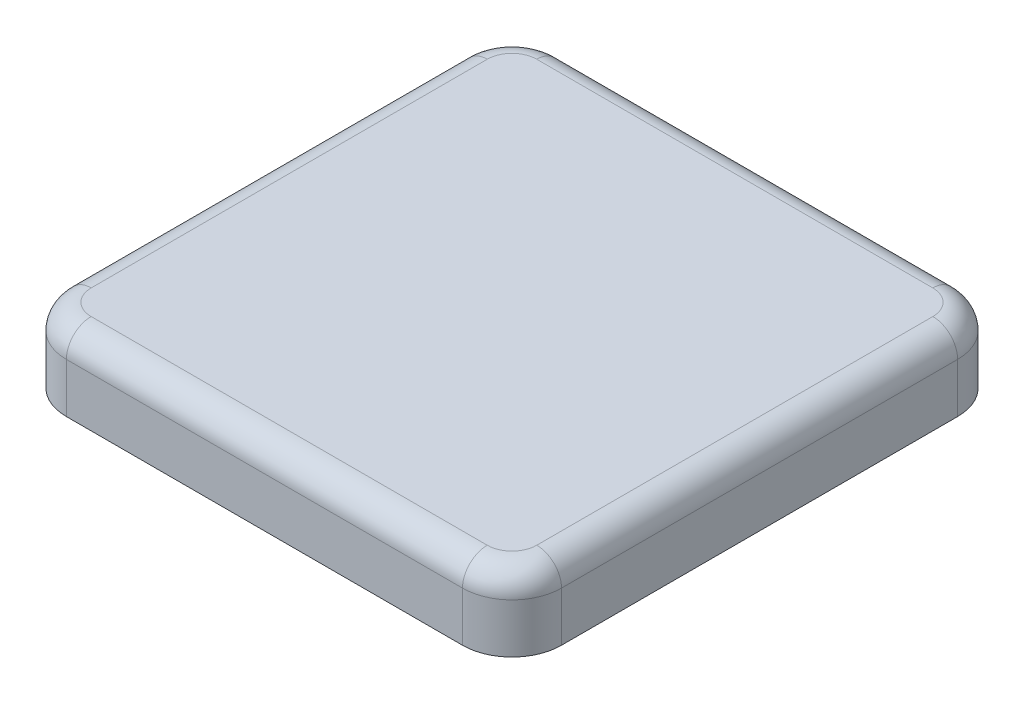
ISO-10303-21;
HEADER;
FILE_DESCRIPTION(('STEP AP214'),'2;1');
FILE_NAME('part.step','',(''),(''),'','','');
FILE_SCHEMA(('AUTOMOTIVE_DESIGN { 1 0 10303 214 1 1 1 1 }'));
ENDSEC;
DATA;
#1=APPLICATION_CONTEXT('core data for automotive mechanical design processes');
#2=APPLICATION_PROTOCOL_DEFINITION('international standard','automotive_design',2000,#1);
#3=PRODUCT_CONTEXT('',#1,'mechanical');
#4=PRODUCT('Part','Part','',(#3));
#5=PRODUCT_RELATED_PRODUCT_CATEGORY('part','',(#4));
#6=PRODUCT_DEFINITION_FORMATION('','',#4);
#7=PRODUCT_DEFINITION_CONTEXT('part definition',#1,'design');
#8=PRODUCT_DEFINITION('design','',#6,#7);
#9=PRODUCT_DEFINITION_SHAPE('','',#8);
#10=(LENGTH_UNIT() NAMED_UNIT(*) SI_UNIT(.MILLI.,.METRE.));
#11=(NAMED_UNIT(*) PLANE_ANGLE_UNIT() SI_UNIT($,.RADIAN.));
#12=(NAMED_UNIT(*) SI_UNIT($,.STERADIAN.) SOLID_ANGLE_UNIT());
#13=UNCERTAINTY_MEASURE_WITH_UNIT(LENGTH_MEASURE(1.E-05),#10,'distance_accuracy_value','');
#14=(GEOMETRIC_REPRESENTATION_CONTEXT(3) GLOBAL_UNCERTAINTY_ASSIGNED_CONTEXT((#13)) GLOBAL_UNIT_ASSIGNED_CONTEXT((#10,
#11,#12)) REPRESENTATION_CONTEXT('',''));
#15=CARTESIAN_POINT('',(0.,0.,0.));
#16=DIRECTION('',(0.,0.,1.));
#17=DIRECTION('',(1.,0.,0.));
#18=AXIS2_PLACEMENT_3D('',#15,#16,#17);
#19=CARTESIAN_POINT('',(2.5,2.5,-2.5));
#20=DIRECTION('',(-1.,0.,0.));
#21=DIRECTION('',(0.,0.,1.));
#22=AXIS2_PLACEMENT_3D('',#19,#20,#21);
#23=PLANE('',#22);
#24=DIRECTION('',(0.,0.,-1.));
#25=VECTOR('',#24,1.);
#26=CARTESIAN_POINT('',(2.5,0.,-2.5));
#27=LINE('',#26,#25);
#28=CARTESIAN_POINT('',(2.5,0.,2.5));
#29=VERTEX_POINT('',#28);
#30=CARTESIAN_POINT('',(2.5,0.,-2.5));
#31=VERTEX_POINT('',#30);
#32=EDGE_CURVE('E244',#29,#31,#27,.T.);
#33=ORIENTED_EDGE('',*,*,#32,.T.);
#34=DIRECTION('',(0.,-1.,0.));
#35=VECTOR('',#34,1.);
#36=CARTESIAN_POINT('',(2.5,2.5,-2.5));
#37=LINE('',#36,#35);
#38=CARTESIAN_POINT('',(2.5,4.5,-2.5));
#39=VERTEX_POINT('',#38);
#40=EDGE_CURVE('E190',#39,#31,#37,.T.);
#41=ORIENTED_EDGE('',*,*,#40,.F.);
#42=DIRECTION('',(0.,0.,-1.));
#43=VECTOR('',#42,1.);
#44=CARTESIAN_POINT('',(2.5,4.5,2.5));
#45=LINE('',#44,#43);
#46=CARTESIAN_POINT('',(2.5,4.5,2.5));
#47=VERTEX_POINT('',#46);
#48=EDGE_CURVE('E184',#47,#39,#45,.T.);
#49=ORIENTED_EDGE('',*,*,#48,.F.);
#50=DIRECTION('',(0.,-1.,0.));
#51=VECTOR('',#50,1.);
#52=CARTESIAN_POINT('',(2.5,2.5,2.5));
#53=LINE('',#52,#51);
#54=EDGE_CURVE('E187',#47,#29,#53,.T.);
#55=ORIENTED_EDGE('',*,*,#54,.T.);
#56=EDGE_LOOP('',(#33,#41,#49,#55));
#57=FACE_BOUND('',#56,.T.);
#58=ADVANCED_FACE('F45',(#57),#23,.F.);
#59=CARTESIAN_POINT('',(-2.5,2.5,-2.5));
#60=DIRECTION('',(0.,0.,1.));
#61=DIRECTION('',(1.,0.,0.));
#62=AXIS2_PLACEMENT_3D('',#59,#60,#61);
#63=PLANE('',#62);
#64=DIRECTION('',(-1.,0.,0.));
#65=VECTOR('',#64,1.);
#66=CARTESIAN_POINT('',(-2.5,0.,-2.5));
#67=LINE('',#66,#65);
#68=CARTESIAN_POINT('',(-2.5,0.,-2.5));
#69=VERTEX_POINT('',#68);
#70=EDGE_CURVE('E254',#31,#69,#67,.T.);
#71=ORIENTED_EDGE('',*,*,#70,.T.);
#72=DIRECTION('',(0.,-1.,0.));
#73=VECTOR('',#72,1.);
#74=CARTESIAN_POINT('',(-2.5,2.5,-2.5));
#75=LINE('',#74,#73);
#76=CARTESIAN_POINT('',(-2.5,4.5,-2.5));
#77=VERTEX_POINT('',#76);
#78=EDGE_CURVE('E260',#77,#69,#75,.T.);
#79=ORIENTED_EDGE('',*,*,#78,.F.);
#80=DIRECTION('',(-1.,0.,0.));
#81=VECTOR('',#80,1.);
#82=CARTESIAN_POINT('',(-2.5,4.5,-2.5));
#83=LINE('',#82,#81);
#84=EDGE_CURVE('E195',#39,#77,#83,.T.);
#85=ORIENTED_EDGE('',*,*,#84,.F.);
#86=ORIENTED_EDGE('',*,*,#40,.T.);
#87=EDGE_LOOP('',(#71,#79,#85,#86));
#88=FACE_BOUND('',#87,.T.);
#89=ADVANCED_FACE('F359',(#88),#63,.F.);
#90=CARTESIAN_POINT('',(-2.5,2.5,-2.5));
#91=DIRECTION('',(1.,0.,0.));
#92=DIRECTION('',(0.,0.,-1.));
#93=AXIS2_PLACEMENT_3D('',#90,#91,#92);
#94=PLANE('',#93);
#95=DIRECTION('',(0.,0.,1.));
#96=VECTOR('',#95,1.);
#97=CARTESIAN_POINT('',(-2.5,0.,-2.5));
#98=LINE('',#97,#96);
#99=CARTESIAN_POINT('',(-2.5,0.,2.5));
#100=VERTEX_POINT('',#99);
#101=EDGE_CURVE('E256',#69,#100,#98,.T.);
#102=ORIENTED_EDGE('',*,*,#101,.T.);
#103=DIRECTION('',(0.,-1.,0.));
#104=VECTOR('',#103,1.);
#105=CARTESIAN_POINT('',(-2.5,2.5,2.5));
#106=LINE('',#105,#104);
#107=CARTESIAN_POINT('',(-2.5,4.5,2.5));
#108=VERTEX_POINT('',#107);
#109=EDGE_CURVE('E206',#108,#100,#106,.T.);
#110=ORIENTED_EDGE('',*,*,#109,.F.);
#111=DIRECTION('',(0.,0.,1.));
#112=VECTOR('',#111,1.);
#113=CARTESIAN_POINT('',(-2.5,4.5,2.5));
#114=LINE('',#113,#112);
#115=EDGE_CURVE('E211',#77,#108,#114,.T.);
#116=ORIENTED_EDGE('',*,*,#115,.F.);
#117=ORIENTED_EDGE('',*,*,#78,.T.);
#118=EDGE_LOOP('',(#102,#110,#116,#117));
#119=FACE_BOUND('',#118,.T.);
#120=ADVANCED_FACE('F362',(#119),#94,.F.);
#121=CARTESIAN_POINT('',(-2.5,2.5,2.5));
#122=DIRECTION('',(0.,0.,-1.));
#123=DIRECTION('',(-1.,0.,0.));
#124=AXIS2_PLACEMENT_3D('',#121,#122,#123);
#125=PLANE('',#124);
#126=DIRECTION('',(1.,0.,0.));
#127=VECTOR('',#126,1.);
#128=CARTESIAN_POINT('',(-2.5,0.,2.5));
#129=LINE('',#128,#127);
#130=EDGE_CURVE('E205',#100,#29,#129,.T.);
#131=ORIENTED_EDGE('',*,*,#130,.T.);
#132=ORIENTED_EDGE('',*,*,#54,.F.);
#133=DIRECTION('',(1.,0.,0.));
#134=VECTOR('',#133,1.);
#135=CARTESIAN_POINT('',(-2.5,4.5,2.5));
#136=LINE('',#135,#134);
#137=EDGE_CURVE('E202',#108,#47,#136,.T.);
#138=ORIENTED_EDGE('',*,*,#137,.F.);
#139=ORIENTED_EDGE('',*,*,#109,.T.);
#140=EDGE_LOOP('',(#131,#132,#138,#139));
#141=FACE_BOUND('',#140,.T.);
#142=ADVANCED_FACE('F200',(#141),#125,.F.);
#143=CARTESIAN_POINT('',(0.,0.,0.));
#144=DIRECTION('',(0.,1.,0.));
#145=DIRECTION('',(0.,0.,1.));
#146=AXIS2_PLACEMENT_3D('',#143,#144,#145);
#147=PLANE('',#146);
#148=DIRECTION('',(1.,0.,0.));
#149=VECTOR('',#148,1.);
#150=CARTESIAN_POINT('',(-2.,0.,2.));
#151=LINE('',#150,#149);
#152=CARTESIAN_POINT('',(-2.,0.,2.));
#153=VERTEX_POINT('',#152);
#154=CARTESIAN_POINT('',(2.,0.,2.));
#155=VERTEX_POINT('',#154);
#156=EDGE_CURVE('E230',#153,#155,#151,.T.);
#157=ORIENTED_EDGE('',*,*,#156,.T.);
#158=DIRECTION('',(0.,0.,-1.));
#159=VECTOR('',#158,1.);
#160=CARTESIAN_POINT('',(2.,0.,2.));
#161=LINE('',#160,#159);
#162=CARTESIAN_POINT('',(2.,0.,-2.));
#163=VERTEX_POINT('',#162);
#164=EDGE_CURVE('E220',#155,#163,#161,.T.);
#165=ORIENTED_EDGE('',*,*,#164,.T.);
#166=DIRECTION('',(-1.,0.,0.));
#167=VECTOR('',#166,1.);
#168=CARTESIAN_POINT('',(-2.,0.,-2.));
#169=LINE('',#168,#167);
#170=CARTESIAN_POINT('',(-2.,0.,-2.));
#171=VERTEX_POINT('',#170);
#172=EDGE_CURVE('E223',#163,#171,#169,.T.);
#173=ORIENTED_EDGE('',*,*,#172,.T.);
#174=DIRECTION('',(0.,0.,1.));
#175=VECTOR('',#174,1.);
#176=CARTESIAN_POINT('',(-2.,0.,2.));
#177=LINE('',#176,#175);
#178=EDGE_CURVE('E227',#171,#153,#177,.T.);
#179=ORIENTED_EDGE('',*,*,#178,.T.);
#180=EDGE_LOOP('',(#157,#165,#173,#179));
#181=FACE_BOUND('',#180,.T.);
#182=ORIENTED_EDGE('',*,*,#32,.F.);
#183=ORIENTED_EDGE('',*,*,#130,.F.);
#184=ORIENTED_EDGE('',*,*,#101,.F.);
#185=ORIENTED_EDGE('',*,*,#70,.F.);
#186=EDGE_LOOP('',(#182,#183,#184,#185));
#187=FACE_BOUND('',#186,.T.);
#188=ADVANCED_FACE('F364',(#181,#187),#147,.F.);
#189=CARTESIAN_POINT('',(2.,0.,2.));
#190=DIRECTION('',(1.,0.,0.));
#191=DIRECTION('',(0.,0.,-1.));
#192=AXIS2_PLACEMENT_3D('',#189,#190,#191);
#193=PLANE('',#192);
#194=DIRECTION('',(0.,0.,-1.));
#195=VECTOR('',#194,1.);
#196=CARTESIAN_POINT('',(2.,2.5,2.));
#197=LINE('',#196,#195);
#198=CARTESIAN_POINT('',(2.,2.5,2.));
#199=VERTEX_POINT('',#198);
#200=CARTESIAN_POINT('',(2.,2.5,-2.));
#201=VERTEX_POINT('',#200);
#202=EDGE_CURVE('E212',#199,#201,#197,.T.);
#203=ORIENTED_EDGE('',*,*,#202,.T.);
#204=DIRECTION('',(0.,1.,0.));
#205=VECTOR('',#204,1.);
#206=CARTESIAN_POINT('',(2.,0.,-2.));
#207=LINE('',#206,#205);
#208=EDGE_CURVE('E232',#163,#201,#207,.T.);
#209=ORIENTED_EDGE('',*,*,#208,.F.);
#210=ORIENTED_EDGE('',*,*,#164,.F.);
#211=DIRECTION('',(0.,1.,0.));
#212=VECTOR('',#211,1.);
#213=CARTESIAN_POINT('',(2.,0.,2.));
#214=LINE('',#213,#212);
#215=EDGE_CURVE('E241',#155,#199,#214,.T.);
#216=ORIENTED_EDGE('',*,*,#215,.T.);
#217=EDGE_LOOP('',(#203,#209,#210,#216));
#218=FACE_BOUND('',#217,.T.);
#219=ADVANCED_FACE('F366',(#218),#193,.F.);
#220=CARTESIAN_POINT('',(-2.,0.,2.));
#221=DIRECTION('',(0.,0.,1.));
#222=DIRECTION('',(1.,0.,0.));
#223=AXIS2_PLACEMENT_3D('',#220,#221,#222);
#224=PLANE('',#223);
#225=DIRECTION('',(1.,0.,0.));
#226=VECTOR('',#225,1.);
#227=CARTESIAN_POINT('',(-2.,2.5,2.));
#228=LINE('',#227,#226);
#229=CARTESIAN_POINT('',(-2.,2.5,2.));
#230=VERTEX_POINT('',#229);
#231=EDGE_CURVE('E224',#230,#199,#228,.T.);
#232=ORIENTED_EDGE('',*,*,#231,.T.);
#233=ORIENTED_EDGE('',*,*,#215,.F.);
#234=ORIENTED_EDGE('',*,*,#156,.F.);
#235=DIRECTION('',(0.,1.,0.));
#236=VECTOR('',#235,1.);
#237=CARTESIAN_POINT('',(-2.,0.,2.));
#238=LINE('',#237,#236);
#239=EDGE_CURVE('E245',#153,#230,#238,.T.);
#240=ORIENTED_EDGE('',*,*,#239,.T.);
#241=EDGE_LOOP('',(#232,#233,#234,#240));
#242=FACE_BOUND('',#241,.T.);
#243=ADVANCED_FACE('F372',(#242),#224,.F.);
#244=CARTESIAN_POINT('',(-2.,0.,2.));
#245=DIRECTION('',(-1.,0.,0.));
#246=DIRECTION('',(0.,0.,1.));
#247=AXIS2_PLACEMENT_3D('',#244,#245,#246);
#248=PLANE('',#247);
#249=DIRECTION('',(0.,0.,1.));
#250=VECTOR('',#249,1.);
#251=CARTESIAN_POINT('',(-2.,2.5,2.));
#252=LINE('',#251,#250);
#253=CARTESIAN_POINT('',(-2.,2.5,-2.));
#254=VERTEX_POINT('',#253);
#255=EDGE_CURVE('E236',#254,#230,#252,.T.);
#256=ORIENTED_EDGE('',*,*,#255,.T.);
#257=ORIENTED_EDGE('',*,*,#239,.F.);
#258=ORIENTED_EDGE('',*,*,#178,.F.);
#259=DIRECTION('',(0.,1.,0.));
#260=VECTOR('',#259,1.);
#261=CARTESIAN_POINT('',(-2.,0.,-2.));
#262=LINE('',#261,#260);
#263=EDGE_CURVE('E248',#171,#254,#262,.T.);
#264=ORIENTED_EDGE('',*,*,#263,.T.);
#265=EDGE_LOOP('',(#256,#257,#258,#264));
#266=FACE_BOUND('',#265,.T.);
#267=ADVANCED_FACE('F482',(#266),#248,.F.);
#268=CARTESIAN_POINT('',(-2.,0.,-2.));
#269=DIRECTION('',(0.,0.,-1.));
#270=DIRECTION('',(-1.,0.,0.));
#271=AXIS2_PLACEMENT_3D('',#268,#269,#270);
#272=PLANE('',#271);
#273=DIRECTION('',(-1.,0.,0.));
#274=VECTOR('',#273,1.);
#275=CARTESIAN_POINT('',(-2.,2.5,-2.));
#276=LINE('',#275,#274);
#277=EDGE_CURVE('E215',#201,#254,#276,.T.);
#278=ORIENTED_EDGE('',*,*,#277,.T.);
#279=ORIENTED_EDGE('',*,*,#263,.F.);
#280=ORIENTED_EDGE('',*,*,#172,.F.);
#281=ORIENTED_EDGE('',*,*,#208,.T.);
#282=EDGE_LOOP('',(#278,#279,#280,#281));
#283=FACE_BOUND('',#282,.T.);
#284=ADVANCED_FACE('F475',(#283),#272,.F.);
#285=CARTESIAN_POINT('',(0.,2.5,0.));
#286=DIRECTION('',(0.,-1.,0.));
#287=DIRECTION('',(0.,0.,-1.));
#288=AXIS2_PLACEMENT_3D('',#285,#286,#287);
#289=PLANE('',#288);
#290=ORIENTED_EDGE('',*,*,#202,.F.);
#291=ORIENTED_EDGE('',*,*,#231,.F.);
#292=ORIENTED_EDGE('',*,*,#255,.F.);
#293=ORIENTED_EDGE('',*,*,#277,.F.);
#294=EDGE_LOOP('',(#290,#291,#292,#293));
#295=FACE_BOUND('',#294,.T.);
#296=ADVANCED_FACE('F468',(#295),#289,.T.);
#297=CARTESIAN_POINT('',(10.,7.5,10.));
#298=DIRECTION('',(-1.,0.,0.));
#299=DIRECTION('',(0.,0.,1.));
#300=AXIS2_PLACEMENT_3D('',#297,#298,#299);
#301=PLANE('',#300);
#302=DIRECTION('',(0.,-1.,0.));
#303=VECTOR('',#302,1.);
#304=CARTESIAN_POINT('',(10.,7.5,-8.));
#305=LINE('',#304,#303);
#306=CARTESIAN_POINT('',(10.,4.5,-8.));
#307=VERTEX_POINT('',#306);
#308=CARTESIAN_POINT('',(10.,6.5,-8.));
#309=VERTEX_POINT('',#308);
#310=EDGE_CURVE('E284',#307,#309,#305,.F.);
#311=ORIENTED_EDGE('',*,*,#310,.T.);
#312=DIRECTION('',(0.,0.,-1.));
#313=VECTOR('',#312,1.);
#314=CARTESIAN_POINT('',(10.,6.5,10.));
#315=LINE('',#314,#313);
#316=CARTESIAN_POINT('',(10.,6.5,8.));
#317=VERTEX_POINT('',#316);
#318=EDGE_CURVE('E11',#309,#317,#315,.F.);
#319=ORIENTED_EDGE('',*,*,#318,.T.);
#320=DIRECTION('',(0.,-1.,0.));
#321=VECTOR('',#320,1.);
#322=CARTESIAN_POINT('',(10.,7.5,8.));
#323=LINE('',#322,#321);
#324=CARTESIAN_POINT('',(10.,4.5,8.));
#325=VERTEX_POINT('',#324);
#326=EDGE_CURVE('E282',#317,#325,#323,.T.);
#327=ORIENTED_EDGE('',*,*,#326,.T.);
#328=DIRECTION('',(0.,0.,-1.));
#329=VECTOR('',#328,1.);
#330=CARTESIAN_POINT('',(10.,4.5,10.));
#331=LINE('',#330,#329);
#332=EDGE_CURVE('E342',#325,#307,#331,.T.);
#333=ORIENTED_EDGE('',*,*,#332,.T.);
#334=EDGE_LOOP('',(#311,#319,#327,#333));
#335=FACE_BOUND('',#334,.T.);
#336=ADVANCED_FACE('F466',(#335),#301,.F.);
#337=CARTESIAN_POINT('',(-10.,7.5,-10.));
#338=DIRECTION('',(0.,0.,1.));
#339=DIRECTION('',(1.,0.,0.));
#340=AXIS2_PLACEMENT_3D('',#337,#338,#339);
#341=PLANE('',#340);
#342=DIRECTION('',(0.,-1.,0.));
#343=VECTOR('',#342,1.);
#344=CARTESIAN_POINT('',(-8.,7.5,-10.));
#345=LINE('',#344,#343);
#346=CARTESIAN_POINT('',(-8.,4.5,-10.));
#347=VERTEX_POINT('',#346);
#348=CARTESIAN_POINT('',(-8.,6.5,-10.));
#349=VERTEX_POINT('',#348);
#350=EDGE_CURVE('E279',#347,#349,#345,.F.);
#351=ORIENTED_EDGE('',*,*,#350,.T.);
#352=DIRECTION('',(-1.,0.,0.));
#353=VECTOR('',#352,1.);
#354=CARTESIAN_POINT('',(-10.,6.5,-10.));
#355=LINE('',#354,#353);
#356=CARTESIAN_POINT('',(8.,6.5,-10.));
#357=VERTEX_POINT('',#356);
#358=EDGE_CURVE('E317',#349,#357,#355,.F.);
#359=ORIENTED_EDGE('',*,*,#358,.T.);
#360=DIRECTION('',(0.,-1.,0.));
#361=VECTOR('',#360,1.);
#362=CARTESIAN_POINT('',(8.,7.5,-10.));
#363=LINE('',#362,#361);
#364=CARTESIAN_POINT('',(8.,4.5,-10.));
#365=VERTEX_POINT('',#364);
#366=EDGE_CURVE('E277',#357,#365,#363,.T.);
#367=ORIENTED_EDGE('',*,*,#366,.T.);
#368=DIRECTION('',(-1.,0.,0.));
#369=VECTOR('',#368,1.);
#370=CARTESIAN_POINT('',(-10.,4.5,-10.));
#371=LINE('',#370,#369);
#372=EDGE_CURVE('E348',#365,#347,#371,.T.);
#373=ORIENTED_EDGE('',*,*,#372,.T.);
#374=EDGE_LOOP('',(#351,#359,#367,#373));
#375=FACE_BOUND('',#374,.T.);
#376=ADVANCED_FACE('F463',(#375),#341,.F.);
#377=CARTESIAN_POINT('',(-10.,7.5,10.));
#378=DIRECTION('',(1.,0.,0.));
#379=DIRECTION('',(0.,0.,-1.));
#380=AXIS2_PLACEMENT_3D('',#377,#378,#379);
#381=PLANE('',#380);
#382=DIRECTION('',(0.,-1.,0.));
#383=VECTOR('',#382,1.);
#384=CARTESIAN_POINT('',(-10.,7.5,8.));
#385=LINE('',#384,#383);
#386=CARTESIAN_POINT('',(-10.,4.5,8.));
#387=VERTEX_POINT('',#386);
#388=CARTESIAN_POINT('',(-10.,6.5,8.));
#389=VERTEX_POINT('',#388);
#390=EDGE_CURVE('E264',#387,#389,#385,.F.);
#391=ORIENTED_EDGE('',*,*,#390,.T.);
#392=DIRECTION('',(0.,0.,1.));
#393=VECTOR('',#392,1.);
#394=CARTESIAN_POINT('',(-10.,6.5,10.));
#395=LINE('',#394,#393);
#396=CARTESIAN_POINT('',(-10.,6.5,-8.));
#397=VERTEX_POINT('',#396);
#398=EDGE_CURVE('E313',#389,#397,#395,.F.);
#399=ORIENTED_EDGE('',*,*,#398,.T.);
#400=DIRECTION('',(0.,-1.,0.));
#401=VECTOR('',#400,1.);
#402=CARTESIAN_POINT('',(-10.,7.5,-8.));
#403=LINE('',#402,#401);
#404=CARTESIAN_POINT('',(-10.,4.5,-8.));
#405=VERTEX_POINT('',#404);
#406=EDGE_CURVE('E267',#397,#405,#403,.T.);
#407=ORIENTED_EDGE('',*,*,#406,.T.);
#408=DIRECTION('',(0.,0.,1.));
#409=VECTOR('',#408,1.);
#410=CARTESIAN_POINT('',(-10.,4.5,10.));
#411=LINE('',#410,#409);
#412=EDGE_CURVE('E352',#405,#387,#411,.T.);
#413=ORIENTED_EDGE('',*,*,#412,.T.);
#414=EDGE_LOOP('',(#391,#399,#407,#413));
#415=FACE_BOUND('',#414,.T.);
#416=ADVANCED_FACE('F455',(#415),#381,.F.);
#417=CARTESIAN_POINT('',(-10.,7.5,10.));
#418=DIRECTION('',(0.,0.,-1.));
#419=DIRECTION('',(-1.,0.,0.));
#420=AXIS2_PLACEMENT_3D('',#417,#418,#419);
#421=PLANE('',#420);
#422=DIRECTION('',(0.,-1.,0.));
#423=VECTOR('',#422,1.);
#424=CARTESIAN_POINT('',(8.,7.5,10.));
#425=LINE('',#424,#423);
#426=CARTESIAN_POINT('',(8.,4.5,10.));
#427=VERTEX_POINT('',#426);
#428=CARTESIAN_POINT('',(8.,6.5,10.));
#429=VERTEX_POINT('',#428);
#430=EDGE_CURVE('E288',#427,#429,#425,.F.);
#431=ORIENTED_EDGE('',*,*,#430,.T.);
#432=DIRECTION('',(1.,0.,0.));
#433=VECTOR('',#432,1.);
#434=CARTESIAN_POINT('',(-10.,6.5,10.));
#435=LINE('',#434,#433);
#436=CARTESIAN_POINT('',(-8.,6.5,10.));
#437=VERTEX_POINT('',#436);
#438=EDGE_CURVE('E308',#429,#437,#435,.F.);
#439=ORIENTED_EDGE('',*,*,#438,.T.);
#440=DIRECTION('',(0.,-1.,0.));
#441=VECTOR('',#440,1.);
#442=CARTESIAN_POINT('',(-8.,7.5,10.));
#443=LINE('',#442,#441);
#444=CARTESIAN_POINT('',(-8.,4.5,10.));
#445=VERTEX_POINT('',#444);
#446=EDGE_CURVE('E286',#437,#445,#443,.T.);
#447=ORIENTED_EDGE('',*,*,#446,.T.);
#448=DIRECTION('',(1.,0.,0.));
#449=VECTOR('',#448,1.);
#450=CARTESIAN_POINT('',(-10.,4.5,10.));
#451=LINE('',#450,#449);
#452=EDGE_CURVE('E196',#445,#427,#451,.T.);
#453=ORIENTED_EDGE('',*,*,#452,.T.);
#454=EDGE_LOOP('',(#431,#439,#447,#453));
#455=FACE_BOUND('',#454,.T.);
#456=ADVANCED_FACE('F443',(#455),#421,.F.);
#457=CARTESIAN_POINT('',(0.,7.5,0.));
#458=DIRECTION('',(0.,-1.,0.));
#459=DIRECTION('',(0.,0.,-1.));
#460=AXIS2_PLACEMENT_3D('',#457,#458,#459);
#461=PLANE('',#460);
#462=CARTESIAN_POINT('',(-8.,7.5,8.));
#463=DIRECTION('',(0.,-1.,0.));
#464=DIRECTION('',(0.,0.,-1.));
#465=AXIS2_PLACEMENT_3D('',#462,#463,#464);
#466=CIRCLE('',#465,1.);
#467=CARTESIAN_POINT('',(-9.00000000000001,7.5,8.));
#468=VERTEX_POINT('',#467);
#469=CARTESIAN_POINT('',(-8.,7.5,9.));
#470=VERTEX_POINT('',#469);
#471=EDGE_CURVE('E303',#468,#470,#466,.F.);
#472=ORIENTED_EDGE('',*,*,#471,.T.);
#473=DIRECTION('',(1.,0.,0.));
#474=VECTOR('',#473,1.);
#475=CARTESIAN_POINT('',(0.,7.5,9.));
#476=LINE('',#475,#474);
#477=CARTESIAN_POINT('',(8.,7.5,9.));
#478=VERTEX_POINT('',#477);
#479=EDGE_CURVE('E305',#470,#478,#476,.T.);
#480=ORIENTED_EDGE('',*,*,#479,.T.);
#481=CARTESIAN_POINT('',(8.,7.5,8.));
#482=DIRECTION('',(0.,-1.,0.));
#483=DIRECTION('',(0.,0.,-1.));
#484=AXIS2_PLACEMENT_3D('',#481,#482,#483);
#485=CIRCLE('',#484,1.);
#486=CARTESIAN_POINT('',(9.,7.5,8.));
#487=VERTEX_POINT('',#486);
#488=EDGE_CURVE('E293',#478,#487,#485,.F.);
#489=ORIENTED_EDGE('',*,*,#488,.T.);
#490=DIRECTION('',(0.,0.,-1.));
#491=VECTOR('',#490,1.);
#492=CARTESIAN_POINT('',(9.,7.5,0.));
#493=LINE('',#492,#491);
#494=CARTESIAN_POINT('',(9.,7.5,-8.));
#495=VERTEX_POINT('',#494);
#496=EDGE_CURVE('E291',#487,#495,#493,.T.);
#497=ORIENTED_EDGE('',*,*,#496,.T.);
#498=CARTESIAN_POINT('',(8.,7.5,-8.));
#499=DIRECTION('',(0.,-1.,0.));
#500=DIRECTION('',(0.,0.,-1.));
#501=AXIS2_PLACEMENT_3D('',#498,#499,#500);
#502=CIRCLE('',#501,1.);
#503=CARTESIAN_POINT('',(8.,7.5,-9.));
#504=VERTEX_POINT('',#503);
#505=EDGE_CURVE('E295',#495,#504,#502,.F.);
#506=ORIENTED_EDGE('',*,*,#505,.T.);
#507=DIRECTION('',(-1.,0.,0.));
#508=VECTOR('',#507,1.);
#509=CARTESIAN_POINT('',(0.,7.5,-9.));
#510=LINE('',#509,#508);
#511=CARTESIAN_POINT('',(-8.,7.5,-9.));
#512=VERTEX_POINT('',#511);
#513=EDGE_CURVE('E297',#504,#512,#510,.T.);
#514=ORIENTED_EDGE('',*,*,#513,.T.);
#515=CARTESIAN_POINT('',(-8.,7.5,-8.));
#516=DIRECTION('',(0.,-1.,0.));
#517=DIRECTION('',(0.,0.,-1.));
#518=AXIS2_PLACEMENT_3D('',#515,#516,#517);
#519=CIRCLE('',#518,1.);
#520=CARTESIAN_POINT('',(-9.00000000000001,7.5,-8.));
#521=VERTEX_POINT('',#520);
#522=EDGE_CURVE('E299',#512,#521,#519,.F.);
#523=ORIENTED_EDGE('',*,*,#522,.T.);
#524=DIRECTION('',(0.,0.,1.));
#525=VECTOR('',#524,1.);
#526=CARTESIAN_POINT('',(-9.00000000000001,7.5,0.));
#527=LINE('',#526,#525);
#528=EDGE_CURVE('E301',#521,#468,#527,.T.);
#529=ORIENTED_EDGE('',*,*,#528,.T.);
#530=EDGE_LOOP('',(#472,#480,#489,#497,#506,#514,#523,#529));
#531=FACE_BOUND('',#530,.T.);
#532=ADVANCED_FACE('F534',(#531),#461,.F.);
#533=CARTESIAN_POINT('',(0.,4.5,0.));
#534=DIRECTION('',(0.,-1.,0.));
#535=DIRECTION('',(0.,0.,-1.));
#536=AXIS2_PLACEMENT_3D('',#533,#534,#535);
#537=PLANE('',#536);
#538=ORIENTED_EDGE('',*,*,#137,.T.);
#539=ORIENTED_EDGE('',*,*,#48,.T.);
#540=ORIENTED_EDGE('',*,*,#84,.T.);
#541=ORIENTED_EDGE('',*,*,#115,.T.);
#542=EDGE_LOOP('',(#538,#539,#540,#541));
#543=FACE_BOUND('',#542,.T.);
#544=ORIENTED_EDGE('',*,*,#412,.F.);
#545=CARTESIAN_POINT('',(-8.,4.5,-8.));
#546=DIRECTION('',(0.,-1.,0.));
#547=DIRECTION('',(0.,0.,-1.));
#548=AXIS2_PLACEMENT_3D('',#545,#546,#547);
#549=CIRCLE('',#548,2.);
#550=EDGE_CURVE('E275',#405,#347,#549,.T.);
#551=ORIENTED_EDGE('',*,*,#550,.T.);
#552=ORIENTED_EDGE('',*,*,#372,.F.);
#553=CARTESIAN_POINT('',(8.,4.5,-8.));
#554=DIRECTION('',(0.,-1.,0.));
#555=DIRECTION('',(0.,0.,-1.));
#556=AXIS2_PLACEMENT_3D('',#553,#554,#555);
#557=CIRCLE('',#556,2.);
#558=EDGE_CURVE('E273',#365,#307,#557,.T.);
#559=ORIENTED_EDGE('',*,*,#558,.T.);
#560=ORIENTED_EDGE('',*,*,#332,.F.);
#561=CARTESIAN_POINT('',(8.,4.5,8.));
#562=DIRECTION('',(0.,-1.,0.));
#563=DIRECTION('',(0.,0.,-1.));
#564=AXIS2_PLACEMENT_3D('',#561,#562,#563);
#565=CIRCLE('',#564,2.);
#566=EDGE_CURVE('E271',#325,#427,#565,.T.);
#567=ORIENTED_EDGE('',*,*,#566,.T.);
#568=ORIENTED_EDGE('',*,*,#452,.F.);
#569=CARTESIAN_POINT('',(-8.,4.5,8.));
#570=DIRECTION('',(0.,-1.,0.));
#571=DIRECTION('',(0.,0.,-1.));
#572=AXIS2_PLACEMENT_3D('',#569,#570,#571);
#573=CIRCLE('',#572,2.);
#574=EDGE_CURVE('E269',#445,#387,#573,.T.);
#575=ORIENTED_EDGE('',*,*,#574,.T.);
#576=EDGE_LOOP('',(#544,#551,#552,#559,#560,#567,#568,#575));
#577=FACE_BOUND('',#576,.T.);
#578=ADVANCED_FACE('F208',(#543,#577),#537,.T.);
#579=CARTESIAN_POINT('',(-8.,7.5,-8.));
#580=DIRECTION('',(0.,-1.,0.));
#581=DIRECTION('',(0.,0.,-1.));
#582=AXIS2_PLACEMENT_3D('',#579,#580,#581);
#583=CYLINDRICAL_SURFACE('',#582,2.);
#584=ORIENTED_EDGE('',*,*,#406,.F.);
#585=CARTESIAN_POINT('',(-8.,6.5,-8.));
#586=DIRECTION('',(0.,-1.,0.));
#587=DIRECTION('',(0.,0.,-1.));
#588=AXIS2_PLACEMENT_3D('',#585,#586,#587);
#589=CIRCLE('',#588,2.);
#590=EDGE_CURVE('E315',#397,#349,#589,.T.);
#591=ORIENTED_EDGE('',*,*,#590,.T.);
#592=ORIENTED_EDGE('',*,*,#350,.F.);
#593=ORIENTED_EDGE('',*,*,#550,.F.);
#594=EDGE_LOOP('',(#584,#591,#592,#593));
#595=FACE_BOUND('',#594,.T.);
#596=ADVANCED_FACE('F386',(#595),#583,.T.);
#597=CARTESIAN_POINT('',(8.,7.5,-8.));
#598=DIRECTION('',(0.,-1.,0.));
#599=DIRECTION('',(0.,0.,-1.));
#600=AXIS2_PLACEMENT_3D('',#597,#598,#599);
#601=CYLINDRICAL_SURFACE('',#600,2.);
#602=ORIENTED_EDGE('',*,*,#366,.F.);
#603=CARTESIAN_POINT('',(8.,6.5,-8.));
#604=DIRECTION('',(0.,-1.,0.));
#605=DIRECTION('',(0.,0.,-1.));
#606=AXIS2_PLACEMENT_3D('',#603,#604,#605);
#607=CIRCLE('',#606,2.);
#608=EDGE_CURVE('E68',#357,#309,#607,.T.);
#609=ORIENTED_EDGE('',*,*,#608,.T.);
#610=ORIENTED_EDGE('',*,*,#310,.F.);
#611=ORIENTED_EDGE('',*,*,#558,.F.);
#612=EDGE_LOOP('',(#602,#609,#610,#611));
#613=FACE_BOUND('',#612,.T.);
#614=ADVANCED_FACE('F389',(#613),#601,.T.);
#615=CARTESIAN_POINT('',(8.,7.5,8.));
#616=DIRECTION('',(0.,-1.,0.));
#617=DIRECTION('',(0.,0.,-1.));
#618=AXIS2_PLACEMENT_3D('',#615,#616,#617);
#619=CYLINDRICAL_SURFACE('',#618,2.);
#620=ORIENTED_EDGE('',*,*,#326,.F.);
#621=CARTESIAN_POINT('',(8.,6.5,8.));
#622=DIRECTION('',(0.,-1.,0.));
#623=DIRECTION('',(0.,0.,-1.));
#624=AXIS2_PLACEMENT_3D('',#621,#622,#623);
#625=CIRCLE('',#624,2.);
#626=EDGE_CURVE('E54',#317,#429,#625,.T.);
#627=ORIENTED_EDGE('',*,*,#626,.T.);
#628=ORIENTED_EDGE('',*,*,#430,.F.);
#629=ORIENTED_EDGE('',*,*,#566,.F.);
#630=EDGE_LOOP('',(#620,#627,#628,#629));
#631=FACE_BOUND('',#630,.T.);
#632=ADVANCED_FACE('F393',(#631),#619,.T.);
#633=CARTESIAN_POINT('',(-8.,7.5,8.));
#634=DIRECTION('',(0.,-1.,0.));
#635=DIRECTION('',(0.,0.,-1.));
#636=AXIS2_PLACEMENT_3D('',#633,#634,#635);
#637=CYLINDRICAL_SURFACE('',#636,2.);
#638=ORIENTED_EDGE('',*,*,#446,.F.);
#639=CARTESIAN_POINT('',(-8.,6.5,8.));
#640=DIRECTION('',(0.,-1.,0.));
#641=DIRECTION('',(0.,0.,-1.));
#642=AXIS2_PLACEMENT_3D('',#639,#640,#641);
#643=CIRCLE('',#642,2.);
#644=EDGE_CURVE('E311',#437,#389,#643,.T.);
#645=ORIENTED_EDGE('',*,*,#644,.T.);
#646=ORIENTED_EDGE('',*,*,#390,.F.);
#647=ORIENTED_EDGE('',*,*,#574,.F.);
#648=EDGE_LOOP('',(#638,#645,#646,#647));
#649=FACE_BOUND('',#648,.T.);
#650=ADVANCED_FACE('F396',(#649),#637,.T.);
#651=CARTESIAN_POINT('',(0.,6.5,-9.));
#652=DIRECTION('',(-1.,0.,0.));
#653=DIRECTION('',(0.,0.,1.));
#654=AXIS2_PLACEMENT_3D('',#651,#652,#653);
#655=CYLINDRICAL_SURFACE('',#654,1.);
#656=CARTESIAN_POINT('',(8.,6.5,-9.));
#657=DIRECTION('',(1.,0.,0.));
#658=DIRECTION('',(0.,0.,-1.));
#659=AXIS2_PLACEMENT_3D('',#656,#657,#658);
#660=CIRCLE('',#659,1.);
#661=EDGE_CURVE('E336',#357,#504,#660,.T.);
#662=ORIENTED_EDGE('',*,*,#661,.F.);
#663=ORIENTED_EDGE('',*,*,#358,.F.);
#664=CARTESIAN_POINT('',(-8.,6.5,-9.));
#665=DIRECTION('',(-1.,0.,0.));
#666=DIRECTION('',(0.,0.,1.));
#667=AXIS2_PLACEMENT_3D('',#664,#665,#666);
#668=CIRCLE('',#667,1.);
#669=EDGE_CURVE('E49',#512,#349,#668,.T.);
#670=ORIENTED_EDGE('',*,*,#669,.F.);
#671=ORIENTED_EDGE('',*,*,#513,.F.);
#672=EDGE_LOOP('',(#662,#663,#670,#671));
#673=FACE_BOUND('',#672,.T.);
#674=ADVANCED_FACE('F47',(#673),#655,.T.);
#675=CARTESIAN_POINT('',(-8.,6.5,-8.));
#676=DIRECTION('',(0.,-1.,0.));
#677=DIRECTION('',(0.,0.,-1.));
#678=AXIS2_PLACEMENT_3D('',#675,#676,#677);
#679=DEGENERATE_TOROIDAL_SURFACE('',#678,1.,1.,.T.);
#680=ORIENTED_EDGE('',*,*,#669,.T.);
#681=ORIENTED_EDGE('',*,*,#590,.F.);
#682=CARTESIAN_POINT('',(-9.00000000000001,6.5,-8.));
#683=DIRECTION('',(0.,0.,1.));
#684=DIRECTION('',(1.,0.,0.));
#685=AXIS2_PLACEMENT_3D('',#682,#683,#684);
#686=CIRCLE('',#685,1.);
#687=EDGE_CURVE('E334',#521,#397,#686,.T.);
#688=ORIENTED_EDGE('',*,*,#687,.F.);
#689=ORIENTED_EDGE('',*,*,#522,.F.);
#690=EDGE_LOOP('',(#680,#681,#688,#689));
#691=FACE_BOUND('',#690,.T.);
#692=ADVANCED_FACE('F423',(#691),#679,.T.);
#693=CARTESIAN_POINT('',(8.,6.5,-8.));
#694=DIRECTION('',(0.,-1.,0.));
#695=DIRECTION('',(0.,0.,-1.));
#696=AXIS2_PLACEMENT_3D('',#693,#694,#695);
#697=DEGENERATE_TOROIDAL_SURFACE('',#696,1.,1.,.T.);
#698=ORIENTED_EDGE('',*,*,#661,.T.);
#699=ORIENTED_EDGE('',*,*,#505,.F.);
#700=CARTESIAN_POINT('',(9.,6.5,-8.));
#701=DIRECTION('',(0.,0.,1.));
#702=DIRECTION('',(0.,-1.,0.));
#703=AXIS2_PLACEMENT_3D('',#700,#701,#702);
#704=CIRCLE('',#703,1.);
#705=EDGE_CURVE('E331',#309,#495,#704,.T.);
#706=ORIENTED_EDGE('',*,*,#705,.F.);
#707=ORIENTED_EDGE('',*,*,#608,.F.);
#708=EDGE_LOOP('',(#698,#699,#706,#707));
#709=FACE_BOUND('',#708,.T.);
#710=ADVANCED_FACE('F420',(#709),#697,.T.);
#711=CARTESIAN_POINT('',(-9.00000000000001,6.5,0.));
#712=DIRECTION('',(0.,0.,1.));
#713=DIRECTION('',(1.,0.,0.));
#714=AXIS2_PLACEMENT_3D('',#711,#712,#713);
#715=CYLINDRICAL_SURFACE('',#714,1.);
#716=ORIENTED_EDGE('',*,*,#687,.T.);
#717=ORIENTED_EDGE('',*,*,#398,.F.);
#718=CARTESIAN_POINT('',(-9.00000000000001,6.5,8.));
#719=DIRECTION('',(0.,0.,1.));
#720=DIRECTION('',(1.,0.,0.));
#721=AXIS2_PLACEMENT_3D('',#718,#719,#720);
#722=CIRCLE('',#721,1.);
#723=EDGE_CURVE('E328',#468,#389,#722,.T.);
#724=ORIENTED_EDGE('',*,*,#723,.F.);
#725=ORIENTED_EDGE('',*,*,#528,.F.);
#726=EDGE_LOOP('',(#716,#717,#724,#725));
#727=FACE_BOUND('',#726,.T.);
#728=ADVANCED_FACE('F416',(#727),#715,.T.);
#729=CARTESIAN_POINT('',(9.,6.5,0.));
#730=DIRECTION('',(0.,0.,-1.));
#731=DIRECTION('',(-1.,0.,0.));
#732=AXIS2_PLACEMENT_3D('',#729,#730,#731);
#733=CYLINDRICAL_SURFACE('',#732,1.);
#734=ORIENTED_EDGE('',*,*,#705,.T.);
#735=ORIENTED_EDGE('',*,*,#496,.F.);
#736=CARTESIAN_POINT('',(9.,6.5,8.));
#737=DIRECTION('',(0.,0.,1.));
#738=DIRECTION('',(1.,0.,0.));
#739=AXIS2_PLACEMENT_3D('',#736,#737,#738);
#740=CIRCLE('',#739,1.);
#741=EDGE_CURVE('E325',#317,#487,#740,.T.);
#742=ORIENTED_EDGE('',*,*,#741,.F.);
#743=ORIENTED_EDGE('',*,*,#318,.F.);
#744=EDGE_LOOP('',(#734,#735,#742,#743));
#745=FACE_BOUND('',#744,.T.);
#746=ADVANCED_FACE('F412',(#745),#733,.T.);
#747=CARTESIAN_POINT('',(-8.,6.5,8.));
#748=DIRECTION('',(0.,-1.,0.));
#749=DIRECTION('',(0.,0.,-1.));
#750=AXIS2_PLACEMENT_3D('',#747,#748,#749);
#751=DEGENERATE_TOROIDAL_SURFACE('',#750,1.,1.,.T.);
#752=ORIENTED_EDGE('',*,*,#723,.T.);
#753=ORIENTED_EDGE('',*,*,#644,.F.);
#754=CARTESIAN_POINT('',(-8.,6.5,9.));
#755=DIRECTION('',(1.,0.,0.));
#756=DIRECTION('',(0.,0.,-1.));
#757=AXIS2_PLACEMENT_3D('',#754,#755,#756);
#758=CIRCLE('',#757,1.);
#759=EDGE_CURVE('E323',#470,#437,#758,.T.);
#760=ORIENTED_EDGE('',*,*,#759,.F.);
#761=ORIENTED_EDGE('',*,*,#471,.F.);
#762=EDGE_LOOP('',(#752,#753,#760,#761));
#763=FACE_BOUND('',#762,.T.);
#764=ADVANCED_FACE('F408',(#763),#751,.T.);
#765=CARTESIAN_POINT('',(8.,6.5,8.));
#766=DIRECTION('',(0.,-1.,0.));
#767=DIRECTION('',(0.,0.,-1.));
#768=AXIS2_PLACEMENT_3D('',#765,#766,#767);
#769=DEGENERATE_TOROIDAL_SURFACE('',#768,1.,1.,.T.);
#770=ORIENTED_EDGE('',*,*,#741,.T.);
#771=ORIENTED_EDGE('',*,*,#488,.F.);
#772=CARTESIAN_POINT('',(8.,6.5,9.));
#773=DIRECTION('',(-1.,0.,0.));
#774=DIRECTION('',(0.,-1.,0.));
#775=AXIS2_PLACEMENT_3D('',#772,#773,#774);
#776=CIRCLE('',#775,1.);
#777=EDGE_CURVE('E321',#429,#478,#776,.T.);
#778=ORIENTED_EDGE('',*,*,#777,.F.);
#779=ORIENTED_EDGE('',*,*,#626,.F.);
#780=EDGE_LOOP('',(#770,#771,#778,#779));
#781=FACE_BOUND('',#780,.T.);
#782=ADVANCED_FACE('F404',(#781),#769,.T.);
#783=CARTESIAN_POINT('',(0.,6.5,9.));
#784=DIRECTION('',(1.,0.,0.));
#785=DIRECTION('',(0.,0.,-1.));
#786=AXIS2_PLACEMENT_3D('',#783,#784,#785);
#787=CYLINDRICAL_SURFACE('',#786,1.);
#788=ORIENTED_EDGE('',*,*,#759,.T.);
#789=ORIENTED_EDGE('',*,*,#438,.F.);
#790=ORIENTED_EDGE('',*,*,#777,.T.);
#791=ORIENTED_EDGE('',*,*,#479,.F.);
#792=EDGE_LOOP('',(#788,#789,#790,#791));
#793=FACE_BOUND('',#792,.T.);
#794=ADVANCED_FACE('F401',(#793),#787,.T.);
#795=CLOSED_SHELL('',(#58,#89,#120,#142,#188,#219,#243,#267,#284,#296,#336,#376,#416,#456,#532,
#578,#596,#614,#632,#650,#674,#692,#710,#728,#746,#764,#782,#794));
#796=MANIFOLD_SOLID_BREP('B2',#795);
#797=ADVANCED_BREP_SHAPE_REPRESENTATION('',(#18,#796),#14);
#798=SHAPE_DEFINITION_REPRESENTATION(#9,#797);
ENDSEC;
END-ISO-10303-21;
